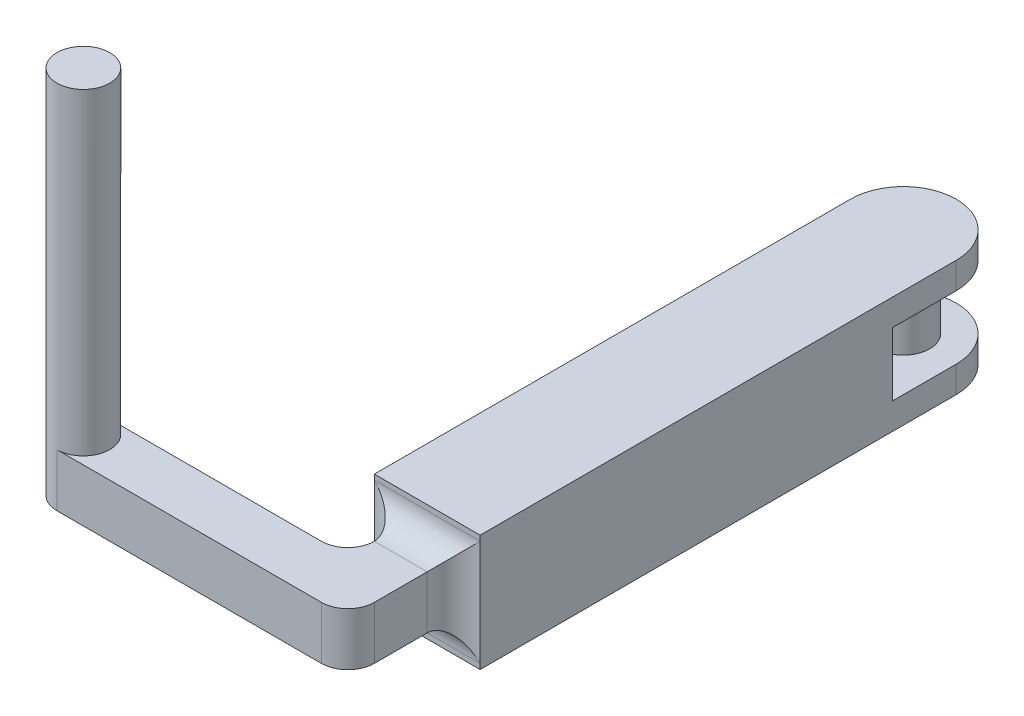
ISO-10303-21;
HEADER;
FILE_DESCRIPTION(('STEP AP214'),'2;1');
FILE_NAME('part.step','',(''),(''),'','','');
FILE_SCHEMA(('AUTOMOTIVE_DESIGN { 1 0 10303 214 1 1 1 1 }'));
ENDSEC;
DATA;
#1=APPLICATION_CONTEXT('core data for automotive mechanical design processes');
#2=APPLICATION_PROTOCOL_DEFINITION('international standard','automotive_design',2000,#1);
#3=PRODUCT_CONTEXT('',#1,'mechanical');
#4=PRODUCT('Part','Part','',(#3));
#5=PRODUCT_RELATED_PRODUCT_CATEGORY('part','',(#4));
#6=PRODUCT_DEFINITION_FORMATION('','',#4);
#7=PRODUCT_DEFINITION_CONTEXT('part definition',#1,'design');
#8=PRODUCT_DEFINITION('design','',#6,#7);
#9=PRODUCT_DEFINITION_SHAPE('','',#8);
#10=(LENGTH_UNIT() NAMED_UNIT(*) SI_UNIT(.MILLI.,.METRE.));
#11=(NAMED_UNIT(*) PLANE_ANGLE_UNIT() SI_UNIT($,.RADIAN.));
#12=(NAMED_UNIT(*) SI_UNIT($,.STERADIAN.) SOLID_ANGLE_UNIT());
#13=UNCERTAINTY_MEASURE_WITH_UNIT(LENGTH_MEASURE(1.E-05),#10,'distance_accuracy_value','');
#14=(GEOMETRIC_REPRESENTATION_CONTEXT(3) GLOBAL_UNCERTAINTY_ASSIGNED_CONTEXT((#13)) GLOBAL_UNIT_ASSIGNED_CONTEXT((#10,
#11,#12)) REPRESENTATION_CONTEXT('',''));
#15=CARTESIAN_POINT('',(0.,0.,0.));
#16=DIRECTION('',(0.,0.,1.));
#17=DIRECTION('',(1.,0.,0.));
#18=AXIS2_PLACEMENT_3D('',#15,#16,#17);
#19=CARTESIAN_POINT('',(0.,6.35,0.));
#20=DIRECTION('',(0.,-1.,0.));
#21=DIRECTION('',(0.,0.,-1.));
#22=AXIS2_PLACEMENT_3D('',#19,#20,#21);
#23=PLANE('',#22);
#24=CARTESIAN_POINT('',(0.,6.35,0.));
#25=DIRECTION('',(0.,1.,0.));
#26=DIRECTION('',(0.,0.,1.));
#27=AXIS2_PLACEMENT_3D('',#24,#25,#26);
#28=CIRCLE('',#27,3.175);
#29=CARTESIAN_POINT('',(0.,6.35,3.175));
#30=VERTEX_POINT('',#29);
#31=CARTESIAN_POINT('',(0.,6.35,-3.175));
#32=VERTEX_POINT('',#31);
#33=EDGE_CURVE('E199',#30,#32,#28,.T.);
#34=ORIENTED_EDGE('',*,*,#33,.F.);
#35=DIRECTION('',(1.,0.,0.));
#36=VECTOR('',#35,1.);
#37=CARTESIAN_POINT('',(34.925,6.35,3.17499999999999));
#38=LINE('',#37,#36);
#39=CARTESIAN_POINT('',(31.75,6.35,3.175));
#40=VERTEX_POINT('',#39);
#41=EDGE_CURVE('E192',#30,#40,#38,.T.);
#42=ORIENTED_EDGE('',*,*,#41,.T.);
#43=CARTESIAN_POINT('',(31.75,6.35,0.));
#44=DIRECTION('',(0.,-1.,0.));
#45=DIRECTION('',(0.,0.,-1.));
#46=AXIS2_PLACEMENT_3D('',#43,#44,#45);
#47=CIRCLE('',#46,3.175);
#48=CARTESIAN_POINT('',(34.925,6.35,0.));
#49=VERTEX_POINT('',#48);
#50=EDGE_CURVE('E215',#40,#49,#47,.F.);
#51=ORIENTED_EDGE('',*,*,#50,.T.);
#52=DIRECTION('',(0.,0.,-1.));
#53=VECTOR('',#52,1.);
#54=CARTESIAN_POINT('',(34.925,6.35,-60.325));
#55=LINE('',#54,#53);
#56=CARTESIAN_POINT('',(34.925,6.35,-6.35));
#57=VERTEX_POINT('',#56);
#58=EDGE_CURVE('E393',#49,#57,#55,.T.);
#59=ORIENTED_EDGE('',*,*,#58,.T.);
#60=DIRECTION('',(1.,0.,0.));
#61=VECTOR('',#60,1.);
#62=CARTESIAN_POINT('',(28.575,6.35,-6.35));
#63=LINE('',#62,#61);
#64=CARTESIAN_POINT('',(28.575,6.35,-6.35));
#65=VERTEX_POINT('',#64);
#66=EDGE_CURVE('E233',#57,#65,#63,.F.);
#67=ORIENTED_EDGE('',*,*,#66,.T.);
#68=CARTESIAN_POINT('',(25.4,6.35,-6.35));
#69=DIRECTION('',(0.,-1.,0.));
#70=DIRECTION('',(0.,0.,-1.));
#71=AXIS2_PLACEMENT_3D('',#68,#69,#70);
#72=CIRCLE('',#71,3.175);
#73=CARTESIAN_POINT('',(25.4,6.35,-3.175));
#74=VERTEX_POINT('',#73);
#75=EDGE_CURVE('E219',#65,#74,#72,.T.);
#76=ORIENTED_EDGE('',*,*,#75,.T.);
#77=DIRECTION('',(-1.,0.,0.));
#78=VECTOR('',#77,1.);
#79=CARTESIAN_POINT('',(-3.175,6.35,-3.175));
#80=LINE('',#79,#78);
#81=EDGE_CURVE('E396',#74,#32,#80,.T.);
#82=ORIENTED_EDGE('',*,*,#81,.T.);
#83=EDGE_LOOP('',(#34,#42,#51,#59,#67,#76,#82));
#84=FACE_BOUND('',#83,.T.);
#85=ADVANCED_FACE('F34',(#84),#23,.F.);
#86=CARTESIAN_POINT('',(-3.176,-0.635,-59.055));
#87=DIRECTION('',(0.,-1.,0.));
#88=DIRECTION('',(0.,0.,-1.));
#89=AXIS2_PLACEMENT_3D('',#86,#87,#88);
#90=PLANE('',#89);
#91=DIRECTION('',(0.,0.,1.));
#92=VECTOR('',#91,1.);
#93=CARTESIAN_POINT('',(25.4,-0.635,-59.055));
#94=LINE('',#93,#92);
#95=CARTESIAN_POINT('',(25.4,-0.635,-66.675));
#96=VERTEX_POINT('',#95);
#97=CARTESIAN_POINT('',(25.4,-0.635,-59.055));
#98=VERTEX_POINT('',#97);
#99=EDGE_CURVE('E631',#96,#98,#94,.T.);
#100=ORIENTED_EDGE('',*,*,#99,.T.);
#101=DIRECTION('',(1.,0.,0.));
#102=VECTOR('',#101,1.);
#103=CARTESIAN_POINT('',(-3.176,-0.635,-59.055));
#104=LINE('',#103,#102);
#105=CARTESIAN_POINT('',(38.1,-0.635,-59.055));
#106=VERTEX_POINT('',#105);
#107=EDGE_CURVE('E365',#98,#106,#104,.T.);
#108=ORIENTED_EDGE('',*,*,#107,.T.);
#109=DIRECTION('',(0.,0.,-1.));
#110=VECTOR('',#109,1.);
#111=CARTESIAN_POINT('',(38.1,-0.635,-59.055));
#112=LINE('',#111,#110);
#113=CARTESIAN_POINT('',(38.1,-0.635,-66.675));
#114=VERTEX_POINT('',#113);
#115=EDGE_CURVE('E639',#106,#114,#112,.T.);
#116=ORIENTED_EDGE('',*,*,#115,.T.);
#117=CARTESIAN_POINT('',(31.75,-0.635,-66.675));
#118=DIRECTION('',(0.,-1.,0.));
#119=DIRECTION('',(0.,0.,-1.));
#120=AXIS2_PLACEMENT_3D('',#117,#118,#119);
#121=CIRCLE('',#120,6.35);
#122=CARTESIAN_POINT('',(31.75,-0.635,-73.025));
#123=VERTEX_POINT('',#122);
#124=EDGE_CURVE('E358',#123,#114,#121,.T.);
#125=ORIENTED_EDGE('',*,*,#124,.F.);
#126=CARTESIAN_POINT('',(31.75,-0.635,-66.675));
#127=DIRECTION('',(0.,-1.,0.));
#128=DIRECTION('',(0.,0.,-1.));
#129=AXIS2_PLACEMENT_3D('',#126,#127,#128);
#130=CIRCLE('',#129,6.35);
#131=EDGE_CURVE('E352',#96,#123,#130,.T.);
#132=ORIENTED_EDGE('',*,*,#131,.F.);
#133=EDGE_LOOP('',(#100,#108,#116,#125,#132));
#134=FACE_BOUND('',#133,.T.);
#135=CARTESIAN_POINT('',(31.75,-0.635,-66.675));
#136=DIRECTION('',(0.,-1.,0.));
#137=DIRECTION('',(0.,0.,-1.));
#138=AXIS2_PLACEMENT_3D('',#135,#136,#137);
#139=CIRCLE('',#138,3.175);
#140=CARTESIAN_POINT('',(31.75,-0.635,-69.85));
#141=VERTEX_POINT('',#140);
#142=EDGE_CURVE('E11',#141,#141,#139,.F.);
#143=ORIENTED_EDGE('',*,*,#142,.F.);
#144=EDGE_LOOP('',(#143));
#145=FACE_BOUND('',#144,.T.);
#146=ADVANCED_FACE('F273',(#134,#145),#90,.F.);
#147=CARTESIAN_POINT('',(-3.176,6.985,-59.055));
#148=DIRECTION('',(0.,1.,0.));
#149=DIRECTION('',(0.,0.,1.));
#150=AXIS2_PLACEMENT_3D('',#147,#148,#149);
#151=PLANE('',#150);
#152=DIRECTION('',(0.,0.,-1.));
#153=VECTOR('',#152,1.);
#154=CARTESIAN_POINT('',(25.4,6.985,-59.055));
#155=LINE('',#154,#153);
#156=CARTESIAN_POINT('',(25.4,6.985,-59.055));
#157=VERTEX_POINT('',#156);
#158=CARTESIAN_POINT('',(25.4,6.985,-66.675));
#159=VERTEX_POINT('',#158);
#160=EDGE_CURVE('E49',#157,#159,#155,.T.);
#161=ORIENTED_EDGE('',*,*,#160,.T.);
#162=CARTESIAN_POINT('',(31.75,6.985,-66.675));
#163=DIRECTION('',(0.,1.,0.));
#164=DIRECTION('',(0.,0.,1.));
#165=AXIS2_PLACEMENT_3D('',#162,#163,#164);
#166=CIRCLE('',#165,6.35);
#167=CARTESIAN_POINT('',(31.75,6.985,-73.025));
#168=VERTEX_POINT('',#167);
#169=EDGE_CURVE('E363',#168,#159,#166,.T.);
#170=ORIENTED_EDGE('',*,*,#169,.F.);
#171=CARTESIAN_POINT('',(31.75,6.985,-66.675));
#172=DIRECTION('',(0.,1.,0.));
#173=DIRECTION('',(0.,0.,1.));
#174=AXIS2_PLACEMENT_3D('',#171,#172,#173);
#175=CIRCLE('',#174,6.35);
#176=CARTESIAN_POINT('',(38.1,6.985,-66.675));
#177=VERTEX_POINT('',#176);
#178=EDGE_CURVE('E622',#177,#168,#175,.T.);
#179=ORIENTED_EDGE('',*,*,#178,.F.);
#180=DIRECTION('',(0.,0.,1.));
#181=VECTOR('',#180,1.);
#182=CARTESIAN_POINT('',(38.1,6.985,-59.055));
#183=LINE('',#182,#181);
#184=CARTESIAN_POINT('',(38.1,6.985,-59.055));
#185=VERTEX_POINT('',#184);
#186=EDGE_CURVE('E633',#177,#185,#183,.T.);
#187=ORIENTED_EDGE('',*,*,#186,.T.);
#188=DIRECTION('',(1.,0.,0.));
#189=VECTOR('',#188,1.);
#190=CARTESIAN_POINT('',(-3.176,6.985,-59.055));
#191=LINE('',#190,#189);
#192=EDGE_CURVE('E641',#157,#185,#191,.T.);
#193=ORIENTED_EDGE('',*,*,#192,.F.);
#194=EDGE_LOOP('',(#161,#170,#179,#187,#193));
#195=FACE_BOUND('',#194,.T.);
#196=CARTESIAN_POINT('',(31.75,6.985,-66.675));
#197=DIRECTION('',(0.,1.,0.));
#198=DIRECTION('',(0.,0.,1.));
#199=AXIS2_PLACEMENT_3D('',#196,#197,#198);
#200=CIRCLE('',#199,3.175);
#201=CARTESIAN_POINT('',(31.75,6.985,-63.5));
#202=VERTEX_POINT('',#201);
#203=EDGE_CURVE('E42',#202,#202,#200,.F.);
#204=ORIENTED_EDGE('',*,*,#203,.F.);
#205=EDGE_LOOP('',(#204));
#206=FACE_BOUND('',#205,.T.);
#207=ADVANCED_FACE('F270',(#195,#206),#151,.F.);
#208=CARTESIAN_POINT('',(31.75,10.16,-66.675));
#209=DIRECTION('',(0.,-1.,0.));
#210=DIRECTION('',(0.,0.,-1.));
#211=AXIS2_PLACEMENT_3D('',#208,#209,#210);
#212=CYLINDRICAL_SURFACE('',#211,6.35);
#213=ORIENTED_EDGE('',*,*,#124,.T.);
#214=DIRECTION('',(0.,-1.,0.));
#215=VECTOR('',#214,1.);
#216=CARTESIAN_POINT('',(38.1,10.16,-66.675));
#217=LINE('',#216,#215);
#218=CARTESIAN_POINT('',(38.1,-3.81,-66.675));
#219=VERTEX_POINT('',#218);
#220=EDGE_CURVE('E260',#219,#114,#217,.F.);
#221=ORIENTED_EDGE('',*,*,#220,.F.);
#222=CARTESIAN_POINT('',(31.75,-3.81,-66.675));
#223=DIRECTION('',(0.,-1.,0.));
#224=DIRECTION('',(0.,0.,-1.));
#225=AXIS2_PLACEMENT_3D('',#222,#223,#224);
#226=CIRCLE('',#225,6.35);
#227=CARTESIAN_POINT('',(31.75,-3.81,-73.025));
#228=VERTEX_POINT('',#227);
#229=EDGE_CURVE('E251',#228,#219,#226,.T.);
#230=ORIENTED_EDGE('',*,*,#229,.F.);
#231=DIRECTION('',(0.,-1.,0.));
#232=VECTOR('',#231,1.);
#233=CARTESIAN_POINT('',(31.75,10.16,-73.025));
#234=LINE('',#233,#232);
#235=EDGE_CURVE('E264',#123,#228,#234,.T.);
#236=ORIENTED_EDGE('',*,*,#235,.F.);
#237=EDGE_LOOP('',(#213,#221,#230,#236));
#238=FACE_BOUND('',#237,.T.);
#239=ADVANCED_FACE('F272',(#238),#212,.T.);
#240=CARTESIAN_POINT('',(31.75,10.16,-66.675));
#241=DIRECTION('',(0.,-1.,0.));
#242=DIRECTION('',(0.,0.,-1.));
#243=AXIS2_PLACEMENT_3D('',#240,#241,#242);
#244=CYLINDRICAL_SURFACE('',#243,6.35);
#245=ORIENTED_EDGE('',*,*,#131,.T.);
#246=ORIENTED_EDGE('',*,*,#235,.T.);
#247=CARTESIAN_POINT('',(31.75,-3.81,-66.675));
#248=DIRECTION('',(0.,-1.,0.));
#249=DIRECTION('',(0.,0.,-1.));
#250=AXIS2_PLACEMENT_3D('',#247,#248,#249);
#251=CIRCLE('',#250,6.35);
#252=CARTESIAN_POINT('',(25.4,-3.81,-66.675));
#253=VERTEX_POINT('',#252);
#254=EDGE_CURVE('E253',#253,#228,#251,.T.);
#255=ORIENTED_EDGE('',*,*,#254,.F.);
#256=DIRECTION('',(0.,-1.,0.));
#257=VECTOR('',#256,1.);
#258=CARTESIAN_POINT('',(25.4,10.16,-66.675));
#259=LINE('',#258,#257);
#260=EDGE_CURVE('E235',#96,#253,#259,.T.);
#261=ORIENTED_EDGE('',*,*,#260,.F.);
#262=EDGE_LOOP('',(#245,#246,#255,#261));
#263=FACE_BOUND('',#262,.T.);
#264=ADVANCED_FACE('F279',(#263),#244,.T.);
#265=CARTESIAN_POINT('',(25.4,10.16,-9.525));
#266=DIRECTION('',(0.,0.,-1.));
#267=DIRECTION('',(-1.,0.,0.));
#268=AXIS2_PLACEMENT_3D('',#265,#266,#267);
#269=PLANE('',#268);
#270=DIRECTION('',(0.,-1.,0.));
#271=VECTOR('',#270,1.);
#272=CARTESIAN_POINT('',(38.1,10.16,-9.525));
#273=LINE('',#272,#271);
#274=CARTESIAN_POINT('',(38.1,-3.175,-9.525));
#275=VERTEX_POINT('',#274);
#276=CARTESIAN_POINT('',(38.1,-3.81,-9.525));
#277=VERTEX_POINT('',#276);
#278=EDGE_CURVE('E382',#275,#277,#273,.T.);
#279=ORIENTED_EDGE('',*,*,#278,.F.);
#280=DIRECTION('',(1.,0.,0.));
#281=VECTOR('',#280,1.);
#282=CARTESIAN_POINT('',(25.4,-3.175,-9.525));
#283=LINE('',#282,#281);
#284=CARTESIAN_POINT('',(25.4,-3.175,-9.525));
#285=VERTEX_POINT('',#284);
#286=EDGE_CURVE('E227',#275,#285,#283,.F.);
#287=ORIENTED_EDGE('',*,*,#286,.T.);
#288=DIRECTION('',(0.,-1.,0.));
#289=VECTOR('',#288,1.);
#290=CARTESIAN_POINT('',(25.4,10.16,-9.525));
#291=LINE('',#290,#289);
#292=CARTESIAN_POINT('',(25.4,-3.81,-9.525));
#293=VERTEX_POINT('',#292);
#294=EDGE_CURVE('E386',#285,#293,#291,.T.);
#295=ORIENTED_EDGE('',*,*,#294,.T.);
#296=DIRECTION('',(1.,0.,0.));
#297=VECTOR('',#296,1.);
#298=CARTESIAN_POINT('',(25.4,-3.81,-9.525));
#299=LINE('',#298,#297);
#300=EDGE_CURVE('E370',#293,#277,#299,.T.);
#301=ORIENTED_EDGE('',*,*,#300,.T.);
#302=EDGE_LOOP('',(#279,#287,#295,#301));
#303=FACE_BOUND('',#302,.T.);
#304=ADVANCED_FACE('F297',(#303),#269,.F.);
#305=CARTESIAN_POINT('',(0.,0.,0.));
#306=DIRECTION('',(0.,-1.,0.));
#307=DIRECTION('',(0.,0.,-1.));
#308=AXIS2_PLACEMENT_3D('',#305,#306,#307);
#309=PLANE('',#308);
#310=CARTESIAN_POINT('',(25.4,0.,-6.35));
#311=DIRECTION('',(0.,-1.,0.));
#312=DIRECTION('',(0.,0.,-1.));
#313=AXIS2_PLACEMENT_3D('',#310,#311,#312);
#314=CIRCLE('',#313,3.175);
#315=CARTESIAN_POINT('',(25.4,0.,-3.175));
#316=VERTEX_POINT('',#315);
#317=CARTESIAN_POINT('',(28.575,0.,-6.35));
#318=VERTEX_POINT('',#317);
#319=EDGE_CURVE('E217',#316,#318,#314,.F.);
#320=ORIENTED_EDGE('',*,*,#319,.T.);
#321=DIRECTION('',(1.,0.,0.));
#322=VECTOR('',#321,1.);
#323=CARTESIAN_POINT('',(0.,0.,-6.35));
#324=LINE('',#323,#322);
#325=CARTESIAN_POINT('',(34.925,0.,-6.35));
#326=VERTEX_POINT('',#325);
#327=EDGE_CURVE('E229',#318,#326,#324,.T.);
#328=ORIENTED_EDGE('',*,*,#327,.T.);
#329=DIRECTION('',(0.,0.,-1.));
#330=VECTOR('',#329,1.);
#331=CARTESIAN_POINT('',(34.925,0.,-60.325));
#332=LINE('',#331,#330);
#333=CARTESIAN_POINT('',(34.925,0.,0.));
#334=VERTEX_POINT('',#333);
#335=EDGE_CURVE('E193',#334,#326,#332,.T.);
#336=ORIENTED_EDGE('',*,*,#335,.F.);
#337=CARTESIAN_POINT('',(31.75,0.,0.));
#338=DIRECTION('',(0.,-1.,0.));
#339=DIRECTION('',(0.,0.,-1.));
#340=AXIS2_PLACEMENT_3D('',#337,#338,#339);
#341=CIRCLE('',#340,3.175);
#342=CARTESIAN_POINT('',(31.75,0.,3.175));
#343=VERTEX_POINT('',#342);
#344=EDGE_CURVE('E209',#334,#343,#341,.T.);
#345=ORIENTED_EDGE('',*,*,#344,.T.);
#346=DIRECTION('',(1.,0.,0.));
#347=VECTOR('',#346,1.);
#348=CARTESIAN_POINT('',(34.925,0.,3.17499999999999));
#349=LINE('',#348,#347);
#350=CARTESIAN_POINT('',(0.,0.,3.175));
#351=VERTEX_POINT('',#350);
#352=EDGE_CURVE('E224',#351,#343,#349,.T.);
#353=ORIENTED_EDGE('',*,*,#352,.F.);
#354=CARTESIAN_POINT('',(0.,0.,0.));
#355=DIRECTION('',(0.,1.,0.));
#356=DIRECTION('',(0.,0.,1.));
#357=AXIS2_PLACEMENT_3D('',#354,#355,#356);
#358=CIRCLE('',#357,3.175);
#359=CARTESIAN_POINT('',(-3.175,0.,0.));
#360=VERTEX_POINT('',#359);
#361=EDGE_CURVE('E179',#360,#351,#358,.T.);
#362=ORIENTED_EDGE('',*,*,#361,.F.);
#363=CARTESIAN_POINT('',(0.,0.,-3.175));
#364=VERTEX_POINT('',#363);
#365=EDGE_CURVE('E172',#364,#360,#358,.T.);
#366=ORIENTED_EDGE('',*,*,#365,.F.);
#367=DIRECTION('',(-1.,0.,0.));
#368=VECTOR('',#367,1.);
#369=CARTESIAN_POINT('',(-3.175,0.,-3.175));
#370=LINE('',#369,#368);
#371=EDGE_CURVE('E176',#316,#364,#370,.T.);
#372=ORIENTED_EDGE('',*,*,#371,.F.);
#373=EDGE_LOOP('',(#320,#328,#336,#345,#353,#362,#366,#372));
#374=FACE_BOUND('',#373,.T.);
#375=ADVANCED_FACE('F175',(#374),#309,.T.);
#376=CARTESIAN_POINT('',(34.925,6.35,-60.325));
#377=DIRECTION('',(-1.,0.,0.));
#378=DIRECTION('',(0.,0.,1.));
#379=AXIS2_PLACEMENT_3D('',#376,#377,#378);
#380=PLANE('',#379);
#381=ORIENTED_EDGE('',*,*,#335,.T.);
#382=DIRECTION('',(0.,-1.,0.));
#383=VECTOR('',#382,1.);
#384=CARTESIAN_POINT('',(34.925,6.35,-6.35));
#385=LINE('',#384,#383);
#386=EDGE_CURVE('E231',#326,#57,#385,.F.);
#387=ORIENTED_EDGE('',*,*,#386,.T.);
#388=ORIENTED_EDGE('',*,*,#58,.F.);
#389=DIRECTION('',(0.,-1.,0.));
#390=VECTOR('',#389,1.);
#391=CARTESIAN_POINT('',(34.925,6.35,0.));
#392=LINE('',#391,#390);
#393=EDGE_CURVE('E206',#49,#334,#392,.T.);
#394=ORIENTED_EDGE('',*,*,#393,.T.);
#395=EDGE_LOOP('',(#381,#387,#388,#394));
#396=FACE_BOUND('',#395,.T.);
#397=ADVANCED_FACE('F296',(#396),#380,.F.);
#398=CARTESIAN_POINT('',(34.925,6.35,3.17499999999999));
#399=DIRECTION('',(0.,0.,-1.));
#400=DIRECTION('',(-1.,0.,0.));
#401=AXIS2_PLACEMENT_3D('',#398,#399,#400);
#402=PLANE('',#401);
#403=ORIENTED_EDGE('',*,*,#352,.T.);
#404=DIRECTION('',(0.,-1.,0.));
#405=VECTOR('',#404,1.);
#406=CARTESIAN_POINT('',(31.75,6.35,3.175));
#407=LINE('',#406,#405);
#408=EDGE_CURVE('E213',#343,#40,#407,.F.);
#409=ORIENTED_EDGE('',*,*,#408,.T.);
#410=ORIENTED_EDGE('',*,*,#41,.F.);
#411=DIRECTION('',(0.,-1.,0.));
#412=VECTOR('',#411,1.);
#413=CARTESIAN_POINT('',(0.,6.35,3.175));
#414=LINE('',#413,#412);
#415=EDGE_CURVE('E211',#30,#351,#414,.T.);
#416=ORIENTED_EDGE('',*,*,#415,.T.);
#417=EDGE_LOOP('',(#403,#409,#410,#416));
#418=FACE_BOUND('',#417,.T.);
#419=ADVANCED_FACE('F301',(#418),#402,.F.);
#420=CARTESIAN_POINT('',(-3.175,6.35,-3.175));
#421=DIRECTION('',(0.,0.,1.));
#422=DIRECTION('',(1.,0.,0.));
#423=AXIS2_PLACEMENT_3D('',#420,#421,#422);
#424=PLANE('',#423);
#425=ORIENTED_EDGE('',*,*,#81,.F.);
#426=DIRECTION('',(0.,-1.,0.));
#427=VECTOR('',#426,1.);
#428=CARTESIAN_POINT('',(25.4,0.,-3.175));
#429=LINE('',#428,#427);
#430=EDGE_CURVE('E191',#74,#316,#429,.T.);
#431=ORIENTED_EDGE('',*,*,#430,.T.);
#432=ORIENTED_EDGE('',*,*,#371,.T.);
#433=DIRECTION('',(0.,-1.,0.));
#434=VECTOR('',#433,1.);
#435=CARTESIAN_POINT('',(0.,6.35,-3.175));
#436=LINE('',#435,#434);
#437=EDGE_CURVE('E183',#364,#32,#436,.F.);
#438=ORIENTED_EDGE('',*,*,#437,.T.);
#439=EDGE_LOOP('',(#425,#431,#432,#438));
#440=FACE_BOUND('',#439,.T.);
#441=ADVANCED_FACE('F188',(#440),#424,.F.);
#442=CARTESIAN_POINT('',(25.4,6.35,-6.35));
#443=DIRECTION('',(0.,1.,0.));
#444=DIRECTION('',(0.,0.,1.));
#445=AXIS2_PLACEMENT_3D('',#442,#443,#444);
#446=CYLINDRICAL_SURFACE('',#445,3.175);
#447=ORIENTED_EDGE('',*,*,#75,.F.);
#448=DIRECTION('',(0.,-1.,0.));
#449=VECTOR('',#448,1.);
#450=CARTESIAN_POINT('',(28.575,6.35,-6.35));
#451=LINE('',#450,#449);
#452=EDGE_CURVE('E201',#318,#65,#451,.F.);
#453=ORIENTED_EDGE('',*,*,#452,.F.);
#454=ORIENTED_EDGE('',*,*,#319,.F.);
#455=ORIENTED_EDGE('',*,*,#430,.F.);
#456=EDGE_LOOP('',(#447,#453,#454,#455));
#457=FACE_BOUND('',#456,.T.);
#458=ADVANCED_FACE('F300',(#457),#446,.F.);
#459=CARTESIAN_POINT('',(31.75,6.35,0.));
#460=DIRECTION('',(0.,-1.,0.));
#461=DIRECTION('',(0.,0.,-1.));
#462=AXIS2_PLACEMENT_3D('',#459,#460,#461);
#463=CYLINDRICAL_SURFACE('',#462,3.175);
#464=ORIENTED_EDGE('',*,*,#50,.F.);
#465=ORIENTED_EDGE('',*,*,#408,.F.);
#466=ORIENTED_EDGE('',*,*,#344,.F.);
#467=ORIENTED_EDGE('',*,*,#393,.F.);
#468=EDGE_LOOP('',(#464,#465,#466,#467));
#469=FACE_BOUND('',#468,.T.);
#470=ADVANCED_FACE('F310',(#469),#463,.T.);
#471=CARTESIAN_POINT('',(0.,6.35,0.));
#472=DIRECTION('',(0.,-1.,0.));
#473=DIRECTION('',(0.,0.,-1.));
#474=AXIS2_PLACEMENT_3D('',#471,#472,#473);
#475=CYLINDRICAL_SURFACE('',#474,3.175);
#476=ORIENTED_EDGE('',*,*,#415,.F.);
#477=ORIENTED_EDGE('',*,*,#33,.T.);
#478=ORIENTED_EDGE('',*,*,#437,.F.);
#479=ORIENTED_EDGE('',*,*,#365,.T.);
#480=DIRECTION('',(0.,-1.,0.));
#481=VECTOR('',#480,1.);
#482=CARTESIAN_POINT('',(-3.175,6.35,0.));
#483=LINE('',#482,#481);
#484=CARTESIAN_POINT('',(-3.175,6.35,0.));
#485=VERTEX_POINT('',#484);
#486=EDGE_CURVE('E222',#360,#485,#483,.F.);
#487=ORIENTED_EDGE('',*,*,#486,.T.);
#488=ORIENTED_EDGE('',*,*,#486,.F.);
#489=ORIENTED_EDGE('',*,*,#361,.T.);
#490=EDGE_LOOP('',(#476,#477,#478,#479,#487,#488,#489));
#491=FACE_BOUND('',#490,.T.);
#492=CARTESIAN_POINT('',(0.,44.45,0.));
#493=DIRECTION('',(0.,1.,0.));
#494=DIRECTION('',(0.,0.,1.));
#495=AXIS2_PLACEMENT_3D('',#492,#493,#494);
#496=CIRCLE('',#495,3.175);
#497=CARTESIAN_POINT('',(0.,44.45,3.175));
#498=VERTEX_POINT('',#497);
#499=EDGE_CURVE('E621',#498,#498,#496,.T.);
#500=ORIENTED_EDGE('',*,*,#499,.F.);
#501=EDGE_LOOP('',(#500));
#502=FACE_BOUND('',#501,.T.);
#503=ADVANCED_FACE('F197',(#491,#502),#475,.T.);
#504=CARTESIAN_POINT('',(25.4,10.16,-9.525));
#505=DIRECTION('',(1.,0.,0.));
#506=DIRECTION('',(0.,0.,-1.));
#507=AXIS2_PLACEMENT_3D('',#504,#505,#506);
#508=PLANE('',#507);
#509=DIRECTION('',(0.,1.,0.));
#510=VECTOR('',#509,1.);
#511=CARTESIAN_POINT('',(25.4,-0.635,-59.055));
#512=LINE('',#511,#510);
#513=EDGE_CURVE('E357',#98,#157,#512,.T.);
#514=ORIENTED_EDGE('',*,*,#513,.F.);
#515=ORIENTED_EDGE('',*,*,#99,.F.);
#516=ORIENTED_EDGE('',*,*,#260,.T.);
#517=DIRECTION('',(0.,0.,1.));
#518=VECTOR('',#517,1.);
#519=CARTESIAN_POINT('',(25.4,-3.81,-9.525));
#520=LINE('',#519,#518);
#521=EDGE_CURVE('E247',#253,#293,#520,.T.);
#522=ORIENTED_EDGE('',*,*,#521,.T.);
#523=ORIENTED_EDGE('',*,*,#294,.F.);
#524=CARTESIAN_POINT('',(25.4,9.525,-9.525));
#525=VERTEX_POINT('',#524);
#526=EDGE_CURVE('E390',#525,#285,#291,.T.);
#527=ORIENTED_EDGE('',*,*,#526,.F.);
#528=CARTESIAN_POINT('',(25.4,10.16,-9.525));
#529=VERTEX_POINT('',#528);
#530=EDGE_CURVE('E225',#529,#525,#291,.T.);
#531=ORIENTED_EDGE('',*,*,#530,.F.);
#532=DIRECTION('',(0.,0.,1.));
#533=VECTOR('',#532,1.);
#534=CARTESIAN_POINT('',(25.4,10.16,-9.525));
#535=LINE('',#534,#533);
#536=CARTESIAN_POINT('',(25.4,10.16,-66.675));
#537=VERTEX_POINT('',#536);
#538=EDGE_CURVE('E376',#537,#529,#535,.T.);
#539=ORIENTED_EDGE('',*,*,#538,.F.);
#540=EDGE_CURVE('E248',#537,#159,#259,.T.);
#541=ORIENTED_EDGE('',*,*,#540,.T.);
#542=ORIENTED_EDGE('',*,*,#160,.F.);
#543=EDGE_LOOP('',(#514,#515,#516,#522,#523,#527,#531,#539,#541,#542));
#544=FACE_BOUND('',#543,.T.);
#545=ADVANCED_FACE('F292',(#544),#508,.F.);
#546=ORIENTED_EDGE('',*,*,#530,.T.);
#547=DIRECTION('',(1.,0.,0.));
#548=VECTOR('',#547,1.);
#549=CARTESIAN_POINT('',(34.925,9.525,-9.525));
#550=LINE('',#549,#548);
#551=CARTESIAN_POINT('',(38.1,9.525,-9.525));
#552=VERTEX_POINT('',#551);
#553=EDGE_CURVE('E221',#525,#552,#550,.T.);
#554=ORIENTED_EDGE('',*,*,#553,.T.);
#555=CARTESIAN_POINT('',(38.1,10.16,-9.525));
#556=VERTEX_POINT('',#555);
#557=EDGE_CURVE('E383',#556,#552,#273,.T.);
#558=ORIENTED_EDGE('',*,*,#557,.F.);
#559=DIRECTION('',(1.,0.,0.));
#560=VECTOR('',#559,1.);
#561=CARTESIAN_POINT('',(25.4,10.16,-9.525));
#562=LINE('',#561,#560);
#563=EDGE_CURVE('E378',#529,#556,#562,.T.);
#564=ORIENTED_EDGE('',*,*,#563,.F.);
#565=EDGE_LOOP('',(#546,#554,#558,#564));
#566=FACE_BOUND('',#565,.T.);
#567=ADVANCED_FACE('F349',(#566),#269,.F.);
#568=CARTESIAN_POINT('',(38.1,10.16,-9.525));
#569=DIRECTION('',(-1.,0.,0.));
#570=DIRECTION('',(0.,0.,1.));
#571=AXIS2_PLACEMENT_3D('',#568,#569,#570);
#572=PLANE('',#571);
#573=ORIENTED_EDGE('',*,*,#220,.T.);
#574=ORIENTED_EDGE('',*,*,#115,.F.);
#575=DIRECTION('',(0.,-1.,0.));
#576=VECTOR('',#575,1.);
#577=CARTESIAN_POINT('',(38.1,-0.635,-59.055));
#578=LINE('',#577,#576);
#579=EDGE_CURVE('E636',#185,#106,#578,.T.);
#580=ORIENTED_EDGE('',*,*,#579,.F.);
#581=ORIENTED_EDGE('',*,*,#186,.F.);
#582=CARTESIAN_POINT('',(38.1,10.16,-66.675));
#583=VERTEX_POINT('',#582);
#584=EDGE_CURVE('E259',#177,#583,#217,.F.);
#585=ORIENTED_EDGE('',*,*,#584,.T.);
#586=DIRECTION('',(0.,0.,-1.));
#587=VECTOR('',#586,1.);
#588=CARTESIAN_POINT('',(38.1,10.16,-9.525));
#589=LINE('',#588,#587);
#590=EDGE_CURVE('E380',#556,#583,#589,.T.);
#591=ORIENTED_EDGE('',*,*,#590,.F.);
#592=ORIENTED_EDGE('',*,*,#557,.T.);
#593=EDGE_CURVE('E387',#552,#275,#273,.T.);
#594=ORIENTED_EDGE('',*,*,#593,.T.);
#595=ORIENTED_EDGE('',*,*,#278,.T.);
#596=DIRECTION('',(0.,0.,-1.));
#597=VECTOR('',#596,1.);
#598=CARTESIAN_POINT('',(38.1,-3.81,-9.525));
#599=LINE('',#598,#597);
#600=EDGE_CURVE('E373',#277,#219,#599,.T.);
#601=ORIENTED_EDGE('',*,*,#600,.T.);
#602=EDGE_LOOP('',(#573,#574,#580,#581,#585,#591,#592,#594,#595,#601));
#603=FACE_BOUND('',#602,.T.);
#604=ADVANCED_FACE('F430',(#603),#572,.F.);
#605=CARTESIAN_POINT('',(0.,10.16,0.));
#606=DIRECTION('',(0.,-1.,0.));
#607=DIRECTION('',(0.,0.,-1.));
#608=AXIS2_PLACEMENT_3D('',#605,#606,#607);
#609=PLANE('',#608);
#610=CARTESIAN_POINT('',(31.75,10.16,-66.675));
#611=DIRECTION('',(0.,-1.,0.));
#612=DIRECTION('',(0.,0.,-1.));
#613=AXIS2_PLACEMENT_3D('',#610,#611,#612);
#614=CIRCLE('',#613,6.35);
#615=CARTESIAN_POINT('',(31.75,10.16,-73.025));
#616=VERTEX_POINT('',#615);
#617=EDGE_CURVE('E57',#583,#616,#614,.F.);
#618=ORIENTED_EDGE('',*,*,#617,.T.);
#619=CARTESIAN_POINT('',(31.75,10.16,-66.675));
#620=DIRECTION('',(0.,-1.,0.));
#621=DIRECTION('',(0.,0.,-1.));
#622=AXIS2_PLACEMENT_3D('',#619,#620,#621);
#623=CIRCLE('',#622,6.35);
#624=EDGE_CURVE('E257',#616,#537,#623,.F.);
#625=ORIENTED_EDGE('',*,*,#624,.T.);
#626=ORIENTED_EDGE('',*,*,#538,.T.);
#627=ORIENTED_EDGE('',*,*,#563,.T.);
#628=ORIENTED_EDGE('',*,*,#590,.T.);
#629=EDGE_LOOP('',(#618,#625,#626,#627,#628));
#630=FACE_BOUND('',#629,.T.);
#631=ADVANCED_FACE('F434',(#630),#609,.F.);
#632=CARTESIAN_POINT('',(0.,-3.81,0.));
#633=DIRECTION('',(0.,-1.,0.));
#634=DIRECTION('',(0.,0.,-1.));
#635=AXIS2_PLACEMENT_3D('',#632,#633,#634);
#636=PLANE('',#635);
#637=ORIENTED_EDGE('',*,*,#521,.F.);
#638=ORIENTED_EDGE('',*,*,#254,.T.);
#639=ORIENTED_EDGE('',*,*,#229,.T.);
#640=ORIENTED_EDGE('',*,*,#600,.F.);
#641=ORIENTED_EDGE('',*,*,#300,.F.);
#642=EDGE_LOOP('',(#637,#638,#639,#640,#641));
#643=FACE_BOUND('',#642,.T.);
#644=ADVANCED_FACE('F331',(#643),#636,.T.);
#645=CARTESIAN_POINT('',(38.1,10.16,-6.35));
#646=DIRECTION('',(0.,1.,0.));
#647=DIRECTION('',(0.,0.,1.));
#648=AXIS2_PLACEMENT_3D('',#645,#646,#647);
#649=CYLINDRICAL_SURFACE('',#648,3.175);
#650=CARTESIAN_POINT('',(38.1,9.525,-6.35));
#651=DIRECTION('',(-0.707106781186547,0.707106781186547,0.));
#652=DIRECTION('',(-0.707106781186547,-0.707106781186547,0.));
#653=AXIS2_PLACEMENT_3D('',#650,#651,#652);
#654=ELLIPSE('',#653,4.49012806053458,3.175);
#655=EDGE_CURVE('E241',#57,#552,#654,.F.);
#656=ORIENTED_EDGE('',*,*,#655,.F.);
#657=ORIENTED_EDGE('',*,*,#386,.F.);
#658=CARTESIAN_POINT('',(38.1,-3.175,-6.35));
#659=DIRECTION('',(0.707106781186547,0.707106781186547,0.));
#660=DIRECTION('',(-0.707106781186547,0.707106781186547,0.));
#661=AXIS2_PLACEMENT_3D('',#658,#659,#660);
#662=ELLIPSE('',#661,4.49012806053458,3.175);
#663=EDGE_CURVE('E244',#275,#326,#662,.T.);
#664=ORIENTED_EDGE('',*,*,#663,.F.);
#665=ORIENTED_EDGE('',*,*,#593,.F.);
#666=EDGE_LOOP('',(#656,#657,#664,#665));
#667=FACE_BOUND('',#666,.T.);
#668=ADVANCED_FACE('F328',(#667),#649,.F.);
#669=CARTESIAN_POINT('',(0.,-3.175,-6.35));
#670=DIRECTION('',(1.,0.,0.));
#671=DIRECTION('',(0.,0.,-1.));
#672=AXIS2_PLACEMENT_3D('',#669,#670,#671);
#673=CYLINDRICAL_SURFACE('',#672,3.175);
#674=ORIENTED_EDGE('',*,*,#663,.T.);
#675=ORIENTED_EDGE('',*,*,#327,.F.);
#676=CARTESIAN_POINT('',(25.4,-3.175,-6.35));
#677=DIRECTION('',(0.707106781186547,-0.707106781186547,0.));
#678=DIRECTION('',(0.707106781186547,0.707106781186547,0.));
#679=AXIS2_PLACEMENT_3D('',#676,#677,#678);
#680=ELLIPSE('',#679,4.49012806053458,3.175);
#681=EDGE_CURVE('E238',#285,#318,#680,.T.);
#682=ORIENTED_EDGE('',*,*,#681,.F.);
#683=ORIENTED_EDGE('',*,*,#286,.F.);
#684=EDGE_LOOP('',(#674,#675,#682,#683));
#685=FACE_BOUND('',#684,.T.);
#686=ADVANCED_FACE('F324',(#685),#673,.F.);
#687=CARTESIAN_POINT('',(25.4,9.525,-6.35));
#688=DIRECTION('',(-1.,0.,0.));
#689=DIRECTION('',(0.,0.,1.));
#690=AXIS2_PLACEMENT_3D('',#687,#688,#689);
#691=CYLINDRICAL_SURFACE('',#690,3.175);
#692=ORIENTED_EDGE('',*,*,#655,.T.);
#693=ORIENTED_EDGE('',*,*,#553,.F.);
#694=CARTESIAN_POINT('',(25.4,9.525,-6.35));
#695=DIRECTION('',(-0.707106781186547,-0.707106781186547,0.));
#696=DIRECTION('',(-0.707106781186547,0.707106781186547,0.));
#697=AXIS2_PLACEMENT_3D('',#694,#695,#696);
#698=ELLIPSE('',#697,4.49012806053458,3.175);
#699=EDGE_CURVE('E236',#65,#525,#698,.F.);
#700=ORIENTED_EDGE('',*,*,#699,.F.);
#701=ORIENTED_EDGE('',*,*,#66,.F.);
#702=EDGE_LOOP('',(#692,#693,#700,#701));
#703=FACE_BOUND('',#702,.T.);
#704=ADVANCED_FACE('F320',(#703),#691,.F.);
#705=CARTESIAN_POINT('',(25.4,10.16,-6.35));
#706=DIRECTION('',(0.,-1.,0.));
#707=DIRECTION('',(0.,0.,-1.));
#708=AXIS2_PLACEMENT_3D('',#705,#706,#707);
#709=CYLINDRICAL_SURFACE('',#708,3.175);
#710=ORIENTED_EDGE('',*,*,#681,.T.);
#711=ORIENTED_EDGE('',*,*,#452,.T.);
#712=ORIENTED_EDGE('',*,*,#699,.T.);
#713=ORIENTED_EDGE('',*,*,#526,.T.);
#714=EDGE_LOOP('',(#710,#711,#712,#713));
#715=FACE_BOUND('',#714,.T.);
#716=ADVANCED_FACE('F317',(#715),#709,.F.);
#717=ORIENTED_EDGE('',*,*,#178,.T.);
#718=EDGE_CURVE('E239',#616,#168,#234,.T.);
#719=ORIENTED_EDGE('',*,*,#718,.F.);
#720=ORIENTED_EDGE('',*,*,#617,.F.);
#721=ORIENTED_EDGE('',*,*,#584,.F.);
#722=EDGE_LOOP('',(#717,#719,#720,#721));
#723=FACE_BOUND('',#722,.T.);
#724=ADVANCED_FACE('F36',(#723),#212,.T.);
#725=ORIENTED_EDGE('',*,*,#169,.T.);
#726=ORIENTED_EDGE('',*,*,#540,.F.);
#727=ORIENTED_EDGE('',*,*,#624,.F.);
#728=ORIENTED_EDGE('',*,*,#718,.T.);
#729=EDGE_LOOP('',(#725,#726,#727,#728));
#730=FACE_BOUND('',#729,.T.);
#731=ADVANCED_FACE('F333',(#730),#244,.T.);
#732=CARTESIAN_POINT('',(-3.176,-0.635,-59.055));
#733=DIRECTION('',(0.,0.,1.));
#734=DIRECTION('',(1.,0.,0.));
#735=AXIS2_PLACEMENT_3D('',#732,#733,#734);
#736=PLANE('',#735);
#737=ORIENTED_EDGE('',*,*,#513,.T.);
#738=ORIENTED_EDGE('',*,*,#192,.T.);
#739=ORIENTED_EDGE('',*,*,#579,.T.);
#740=ORIENTED_EDGE('',*,*,#107,.F.);
#741=EDGE_LOOP('',(#737,#738,#739,#740));
#742=FACE_BOUND('',#741,.T.);
#743=ADVANCED_FACE('F335',(#742),#736,.F.);
#744=CARTESIAN_POINT('',(31.75,9.525,-66.675));
#745=DIRECTION('',(0.,-1.,0.));
#746=DIRECTION('',(0.,0.,-1.));
#747=AXIS2_PLACEMENT_3D('',#744,#745,#746);
#748=CYLINDRICAL_SURFACE('',#747,3.175);
#749=ORIENTED_EDGE('',*,*,#142,.T.);
#750=EDGE_LOOP('',(#749));
#751=FACE_BOUND('',#750,.T.);
#752=ORIENTED_EDGE('',*,*,#203,.T.);
#753=EDGE_LOOP('',(#752));
#754=FACE_BOUND('',#753,.T.);
#755=ADVANCED_FACE('F268',(#751,#754),#748,.T.);
#756=CARTESIAN_POINT('',(0.,44.45,0.));
#757=DIRECTION('',(0.,1.,0.));
#758=DIRECTION('',(0.,0.,1.));
#759=AXIS2_PLACEMENT_3D('',#756,#757,#758);
#760=PLANE('',#759);
#761=ORIENTED_EDGE('',*,*,#499,.T.);
#762=EDGE_LOOP('',(#761));
#763=FACE_BOUND('',#762,.T.);
#764=ADVANCED_FACE('F580',(#763),#760,.T.);
#765=CLOSED_SHELL('',(#85,#146,#207,#239,#264,#304,#375,#397,#419,#441,#458,#470,#503,#545,#567,
#604,#631,#644,#668,#686,#704,#716,#724,#731,#743,#755,#764));
#766=MANIFOLD_SOLID_BREP('B2',#765);
#767=ADVANCED_BREP_SHAPE_REPRESENTATION('',(#18,#766),#14);
#768=SHAPE_DEFINITION_REPRESENTATION(#9,#767);
ENDSEC;
END-ISO-10303-21;
